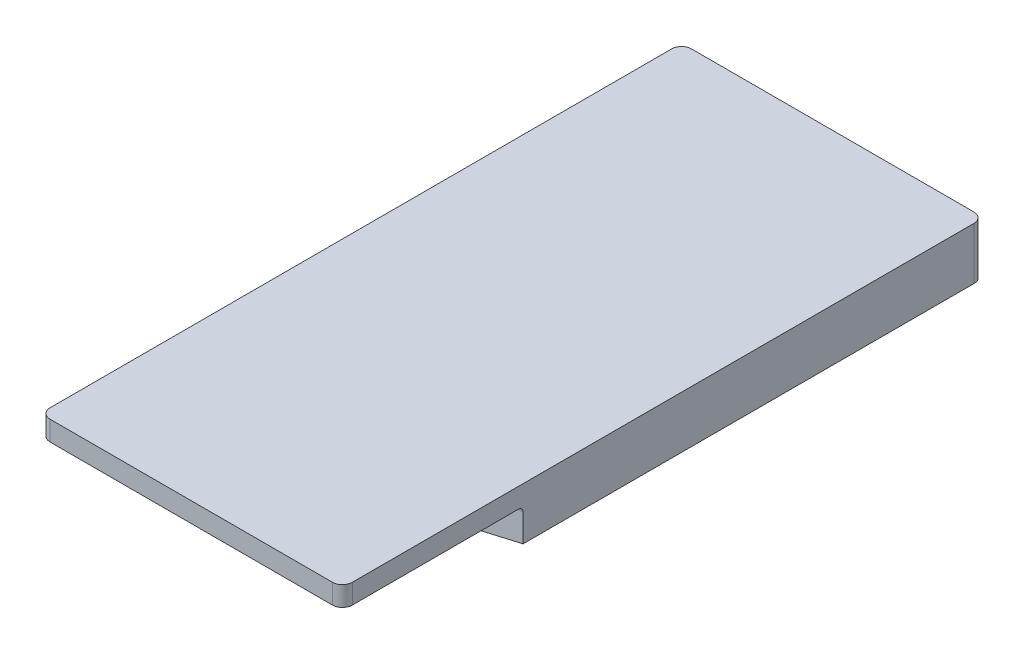
ISO-10303-21;
HEADER;
FILE_DESCRIPTION(('STEP AP214'),'2;1');
FILE_NAME('part.step','',(''),(''),'','','');
FILE_SCHEMA(('AUTOMOTIVE_DESIGN { 1 0 10303 214 1 1 1 1 }'));
ENDSEC;
DATA;
#1=APPLICATION_CONTEXT('core data for automotive mechanical design processes');
#2=APPLICATION_PROTOCOL_DEFINITION('international standard','automotive_design',2000,#1);
#3=PRODUCT_CONTEXT('',#1,'mechanical');
#4=PRODUCT('Part','Part','',(#3));
#5=PRODUCT_RELATED_PRODUCT_CATEGORY('part','',(#4));
#6=PRODUCT_DEFINITION_FORMATION('','',#4);
#7=PRODUCT_DEFINITION_CONTEXT('part definition',#1,'design');
#8=PRODUCT_DEFINITION('design','',#6,#7);
#9=PRODUCT_DEFINITION_SHAPE('','',#8);
#10=(LENGTH_UNIT() NAMED_UNIT(*) SI_UNIT(.MILLI.,.METRE.));
#11=(NAMED_UNIT(*) PLANE_ANGLE_UNIT() SI_UNIT($,.RADIAN.));
#12=(NAMED_UNIT(*) SI_UNIT($,.STERADIAN.) SOLID_ANGLE_UNIT());
#13=UNCERTAINTY_MEASURE_WITH_UNIT(LENGTH_MEASURE(1.E-05),#10,'distance_accuracy_value','');
#14=(GEOMETRIC_REPRESENTATION_CONTEXT(3) GLOBAL_UNCERTAINTY_ASSIGNED_CONTEXT((#13)) GLOBAL_UNIT_ASSIGNED_CONTEXT((#10,
#11,#12)) REPRESENTATION_CONTEXT('',''));
#15=CARTESIAN_POINT('',(0.,0.,0.));
#16=DIRECTION('',(0.,0.,1.));
#17=DIRECTION('',(1.,0.,0.));
#18=AXIS2_PLACEMENT_3D('',#15,#16,#17);
#19=CARTESIAN_POINT('',(-121.01,39.,179.75));
#20=DIRECTION('',(1.,0.,0.));
#21=DIRECTION('',(0.,0.,-1.));
#22=AXIS2_PLACEMENT_3D('',#19,#20,#21);
#23=PLANE('',#22);
#24=DIRECTION('',(0.,-1.,0.));
#25=VECTOR('',#24,1.);
#26=CARTESIAN_POINT('',(-121.01,39.,-411.75));
#27=LINE('',#26,#25);
#28=CARTESIAN_POINT('',(-121.01,39.,-411.75));
#29=VERTEX_POINT('',#28);
#30=CARTESIAN_POINT('',(-121.01,20.009665474438,-411.75));
#31=VERTEX_POINT('',#30);
#32=EDGE_CURVE('E462',#29,#31,#27,.T.);
#33=ORIENTED_EDGE('',*,*,#32,.F.);
#34=DIRECTION('',(0.,0.,-1.));
#35=VECTOR('',#34,1.);
#36=CARTESIAN_POINT('',(-121.01,39.,179.75));
#37=LINE('',#36,#35);
#38=CARTESIAN_POINT('',(-121.01,39.,179.75));
#39=VERTEX_POINT('',#38);
#40=EDGE_CURVE('E238',#39,#29,#37,.T.);
#41=ORIENTED_EDGE('',*,*,#40,.F.);
#42=DIRECTION('',(0.,-1.,0.));
#43=VECTOR('',#42,1.);
#44=CARTESIAN_POINT('',(-121.01,39.,179.75));
#45=LINE('',#44,#43);
#46=CARTESIAN_POINT('',(-121.01,20.009665474438,179.75));
#47=VERTEX_POINT('',#46);
#48=EDGE_CURVE('E233',#39,#47,#45,.T.);
#49=ORIENTED_EDGE('',*,*,#48,.T.);
#50=DIRECTION('',(0.,0.,-1.));
#51=VECTOR('',#50,1.);
#52=CARTESIAN_POINT('',(-121.01,20.009665474438,179.75));
#53=LINE('',#52,#51);
#54=EDGE_CURVE('E215',#47,#31,#53,.T.);
#55=ORIENTED_EDGE('',*,*,#54,.T.);
#56=EDGE_LOOP('',(#33,#41,#49,#55));
#57=FACE_BOUND('',#56,.T.);
#58=ADVANCED_FACE('F45',(#57),#23,.T.);
#59=CARTESIAN_POINT('',(-88.51,39.,179.75));
#60=DIRECTION('',(0.,0.,-1.));
#61=DIRECTION('',(-1.,0.,0.));
#62=AXIS2_PLACEMENT_3D('',#59,#60,#61);
#63=CYLINDRICAL_SURFACE('',#62,32.5);
#64=CARTESIAN_POINT('',(-88.51,39.,-411.75));
#65=DIRECTION('',(0.,0.,1.));
#66=DIRECTION('',(1.,0.,0.));
#67=AXIS2_PLACEMENT_3D('',#64,#65,#66);
#68=CIRCLE('',#67,32.5);
#69=CARTESIAN_POINT('',(-56.01,39.,-411.75));
#70=VERTEX_POINT('',#69);
#71=EDGE_CURVE('E240',#70,#29,#68,.T.);
#72=ORIENTED_EDGE('',*,*,#71,.F.);
#73=DIRECTION('',(0.,0.,-1.));
#74=VECTOR('',#73,1.);
#75=CARTESIAN_POINT('',(-56.01,39.,179.75));
#76=LINE('',#75,#74);
#77=CARTESIAN_POINT('',(-56.01,39.,179.75));
#78=VERTEX_POINT('',#77);
#79=EDGE_CURVE('E466',#78,#70,#76,.T.);
#80=ORIENTED_EDGE('',*,*,#79,.F.);
#81=CARTESIAN_POINT('',(-88.51,39.,179.75));
#82=DIRECTION('',(0.,0.,1.));
#83=DIRECTION('',(1.,0.,0.));
#84=AXIS2_PLACEMENT_3D('',#81,#82,#83);
#85=CIRCLE('',#84,32.5);
#86=EDGE_CURVE('E228',#78,#39,#85,.T.);
#87=ORIENTED_EDGE('',*,*,#86,.T.);
#88=ORIENTED_EDGE('',*,*,#40,.T.);
#89=EDGE_LOOP('',(#72,#80,#87,#88));
#90=FACE_BOUND('',#89,.T.);
#91=ADVANCED_FACE('F564',(#90),#63,.F.);
#92=CARTESIAN_POINT('',(-56.01,5.20647328174899,179.75));
#93=DIRECTION('',(-1.,0.,0.));
#94=DIRECTION('',(0.,-1.,0.));
#95=AXIS2_PLACEMENT_3D('',#92,#93,#94);
#96=PLANE('',#95);
#97=DIRECTION('',(0.,1.,0.));
#98=VECTOR('',#97,1.);
#99=CARTESIAN_POINT('',(-56.01,5.20647328174899,-411.75));
#100=LINE('',#99,#98);
#101=CARTESIAN_POINT('',(-56.0099999999999,5.20647328174895,-411.75));
#102=VERTEX_POINT('',#101);
#103=EDGE_CURVE('E245',#102,#70,#100,.T.);
#104=ORIENTED_EDGE('',*,*,#103,.F.);
#105=DIRECTION('',(0.,0.,-1.));
#106=VECTOR('',#105,1.);
#107=CARTESIAN_POINT('',(-56.0099999999999,5.20647328174895,179.75));
#108=LINE('',#107,#106);
#109=CARTESIAN_POINT('',(-56.0099999999999,5.20647328174895,179.75));
#110=VERTEX_POINT('',#109);
#111=EDGE_CURVE('E436',#110,#102,#108,.T.);
#112=ORIENTED_EDGE('',*,*,#111,.F.);
#113=DIRECTION('',(0.,1.,0.));
#114=VECTOR('',#113,1.);
#115=CARTESIAN_POINT('',(-56.01,5.20647328174899,179.75));
#116=LINE('',#115,#114);
#117=EDGE_CURVE('E452',#110,#78,#116,.T.);
#118=ORIENTED_EDGE('',*,*,#117,.T.);
#119=ORIENTED_EDGE('',*,*,#79,.T.);
#120=EDGE_LOOP('',(#104,#112,#118,#119));
#121=FACE_BOUND('',#120,.T.);
#122=ADVANCED_FACE('F569',(#121),#96,.T.);
#123=CARTESIAN_POINT('',(0.,303.874359168,179.75));
#124=DIRECTION('',(0.,0.,-1.));
#125=DIRECTION('',(-1.,0.,0.));
#126=AXIS2_PLACEMENT_3D('',#123,#124,#125);
#127=CYLINDRICAL_SURFACE('',#126,303.874359168);
#128=CARTESIAN_POINT('',(0.,303.874359168,-411.75));
#129=DIRECTION('',(0.,0.,-1.));
#130=DIRECTION('',(-1.,0.,0.));
#131=AXIS2_PLACEMENT_3D('',#128,#129,#130);
#132=CIRCLE('',#131,303.874359168);
#133=CARTESIAN_POINT('',(56.01,5.20647328174897,-411.75));
#134=VERTEX_POINT('',#133);
#135=EDGE_CURVE('E474',#134,#102,#132,.T.);
#136=ORIENTED_EDGE('',*,*,#135,.F.);
#137=DIRECTION('',(0.,0.,-1.));
#138=VECTOR('',#137,1.);
#139=CARTESIAN_POINT('',(56.01,5.20647328174897,179.75));
#140=LINE('',#139,#138);
#141=CARTESIAN_POINT('',(56.01,5.20647328174897,179.75));
#142=VERTEX_POINT('',#141);
#143=EDGE_CURVE('E432',#142,#134,#140,.T.);
#144=ORIENTED_EDGE('',*,*,#143,.F.);
#145=CARTESIAN_POINT('',(0.,303.874359168,179.75));
#146=DIRECTION('',(0.,0.,-1.));
#147=DIRECTION('',(-1.,0.,0.));
#148=AXIS2_PLACEMENT_3D('',#145,#146,#147);
#149=CIRCLE('',#148,303.874359168);
#150=EDGE_CURVE('E446',#142,#110,#149,.T.);
#151=ORIENTED_EDGE('',*,*,#150,.T.);
#152=ORIENTED_EDGE('',*,*,#111,.T.);
#153=EDGE_LOOP('',(#136,#144,#151,#152));
#154=FACE_BOUND('',#153,.T.);
#155=ADVANCED_FACE('F516',(#154),#127,.T.);
#156=CARTESIAN_POINT('',(56.01,39.,179.75));
#157=DIRECTION('',(1.,0.,0.));
#158=DIRECTION('',(0.,0.,-1.));
#159=AXIS2_PLACEMENT_3D('',#156,#157,#158);
#160=PLANE('',#159);
#161=DIRECTION('',(0.,-1.,0.));
#162=VECTOR('',#161,1.);
#163=CARTESIAN_POINT('',(56.01,39.,-411.75));
#164=LINE('',#163,#162);
#165=CARTESIAN_POINT('',(56.01,39.,-411.75));
#166=VERTEX_POINT('',#165);
#167=EDGE_CURVE('E479',#166,#134,#164,.T.);
#168=ORIENTED_EDGE('',*,*,#167,.F.);
#169=DIRECTION('',(0.,0.,-1.));
#170=VECTOR('',#169,1.);
#171=CARTESIAN_POINT('',(56.01,39.,179.75));
#172=LINE('',#171,#170);
#173=CARTESIAN_POINT('',(56.01,39.,179.75));
#174=VERTEX_POINT('',#173);
#175=EDGE_CURVE('E428',#174,#166,#172,.T.);
#176=ORIENTED_EDGE('',*,*,#175,.F.);
#177=DIRECTION('',(0.,-1.,0.));
#178=VECTOR('',#177,1.);
#179=CARTESIAN_POINT('',(56.01,39.,179.75));
#180=LINE('',#179,#178);
#181=EDGE_CURVE('E453',#174,#142,#180,.T.);
#182=ORIENTED_EDGE('',*,*,#181,.T.);
#183=ORIENTED_EDGE('',*,*,#143,.T.);
#184=EDGE_LOOP('',(#168,#176,#182,#183));
#185=FACE_BOUND('',#184,.T.);
#186=ADVANCED_FACE('F510',(#185),#160,.T.);
#187=CARTESIAN_POINT('',(88.51,39.,179.75));
#188=DIRECTION('',(0.,0.,-1.));
#189=DIRECTION('',(-1.,0.,0.));
#190=AXIS2_PLACEMENT_3D('',#187,#188,#189);
#191=CYLINDRICAL_SURFACE('',#190,32.5);
#192=CARTESIAN_POINT('',(88.51,39.,-411.75));
#193=DIRECTION('',(0.,0.,1.));
#194=DIRECTION('',(1.,0.,0.));
#195=AXIS2_PLACEMENT_3D('',#192,#193,#194);
#196=CIRCLE('',#195,32.5);
#197=CARTESIAN_POINT('',(121.01,39.,-411.75));
#198=VERTEX_POINT('',#197);
#199=EDGE_CURVE('E483',#198,#166,#196,.T.);
#200=ORIENTED_EDGE('',*,*,#199,.F.);
#201=DIRECTION('',(0.,0.,-1.));
#202=VECTOR('',#201,1.);
#203=CARTESIAN_POINT('',(121.01,39.,179.75));
#204=LINE('',#203,#202);
#205=CARTESIAN_POINT('',(121.01,39.,179.75));
#206=VERTEX_POINT('',#205);
#207=EDGE_CURVE('E425',#206,#198,#204,.T.);
#208=ORIENTED_EDGE('',*,*,#207,.F.);
#209=CARTESIAN_POINT('',(88.51,39.,179.75));
#210=DIRECTION('',(0.,0.,1.));
#211=DIRECTION('',(1.,0.,0.));
#212=AXIS2_PLACEMENT_3D('',#209,#210,#211);
#213=CIRCLE('',#212,32.5);
#214=EDGE_CURVE('E499',#206,#174,#213,.T.);
#215=ORIENTED_EDGE('',*,*,#214,.T.);
#216=ORIENTED_EDGE('',*,*,#175,.T.);
#217=EDGE_LOOP('',(#200,#208,#215,#216));
#218=FACE_BOUND('',#217,.T.);
#219=ADVANCED_FACE('F635',(#218),#191,.F.);
#220=CARTESIAN_POINT('',(121.01,20.009665474438,179.75));
#221=DIRECTION('',(-1.,0.,0.));
#222=DIRECTION('',(0.,0.,1.));
#223=AXIS2_PLACEMENT_3D('',#220,#221,#222);
#224=PLANE('',#223);
#225=DIRECTION('',(0.,1.,0.));
#226=VECTOR('',#225,1.);
#227=CARTESIAN_POINT('',(121.01,20.009665474438,-411.75));
#228=LINE('',#227,#226);
#229=CARTESIAN_POINT('',(121.01,20.009665474438,-411.75));
#230=VERTEX_POINT('',#229);
#231=EDGE_CURVE('E402',#230,#198,#228,.T.);
#232=ORIENTED_EDGE('',*,*,#231,.F.);
#233=DIRECTION('',(0.,0.,-1.));
#234=VECTOR('',#233,1.);
#235=CARTESIAN_POINT('',(121.01,20.009665474438,179.75));
#236=LINE('',#235,#234);
#237=CARTESIAN_POINT('',(121.01,20.009665474438,179.75));
#238=VERTEX_POINT('',#237);
#239=EDGE_CURVE('E373',#238,#230,#236,.T.);
#240=ORIENTED_EDGE('',*,*,#239,.F.);
#241=DIRECTION('',(0.,1.,0.));
#242=VECTOR('',#241,1.);
#243=CARTESIAN_POINT('',(121.01,20.009665474438,179.75));
#244=LINE('',#243,#242);
#245=EDGE_CURVE('E495',#238,#206,#244,.T.);
#246=ORIENTED_EDGE('',*,*,#245,.T.);
#247=ORIENTED_EDGE('',*,*,#207,.T.);
#248=EDGE_LOOP('',(#232,#240,#246,#247));
#249=FACE_BOUND('',#248,.T.);
#250=ADVANCED_FACE('F639',(#249),#224,.T.);
#251=CARTESIAN_POINT('',(194.010451035,36.9541925117447,179.75));
#252=DIRECTION('',(0.226104305200991,-0.974103096786771,0.));
#253=DIRECTION('',(0.974103096786771,0.226104305200991,0.));
#254=AXIS2_PLACEMENT_3D('',#251,#252,#253);
#255=PLANE('',#254);
#256=DIRECTION('',(-0.974103096786771,-0.226104305200991,0.));
#257=VECTOR('',#256,1.);
#258=CARTESIAN_POINT('',(194.010451035,36.9541925117447,-411.75));
#259=LINE('',#258,#257);
#260=CARTESIAN_POINT('',(181.310451035,34.006327254438,-411.75));
#261=VERTEX_POINT('',#260);
#262=EDGE_CURVE('E366',#261,#230,#259,.T.);
#263=ORIENTED_EDGE('',*,*,#262,.F.);
#264=CARTESIAN_POINT('',(181.310451035,34.006327254438,-399.05));
#265=DIRECTION('',(0.226104305200991,-0.974103096786771,0.));
#266=DIRECTION('',(0.974103096786771,0.226104305200991,0.));
#267=AXIS2_PLACEMENT_3D('',#264,#265,#266);
#268=ELLIPSE('',#267,13.0376343550214,12.7);
#269=CARTESIAN_POINT('',(194.010451035,36.9541925117447,-399.05));
#270=VERTEX_POINT('',#269);
#271=EDGE_CURVE('E290',#261,#270,#268,.T.);
#272=ORIENTED_EDGE('',*,*,#271,.T.);
#273=DIRECTION('',(0.,0.,-1.));
#274=VECTOR('',#273,1.);
#275=CARTESIAN_POINT('',(194.010451035,36.9541925117447,179.75));
#276=LINE('',#275,#274);
#277=CARTESIAN_POINT('',(194.010451035,36.9541925117447,179.75));
#278=VERTEX_POINT('',#277);
#279=EDGE_CURVE('E363',#278,#270,#276,.T.);
#280=ORIENTED_EDGE('',*,*,#279,.F.);
#281=DIRECTION('',(-0.974103096786771,-0.226104305200991,0.));
#282=VECTOR('',#281,1.);
#283=CARTESIAN_POINT('',(194.010451035,36.9541925117447,179.75));
#284=LINE('',#283,#282);
#285=EDGE_CURVE('E492',#278,#238,#284,.T.);
#286=ORIENTED_EDGE('',*,*,#285,.T.);
#287=ORIENTED_EDGE('',*,*,#239,.T.);
#288=EDGE_LOOP('',(#263,#272,#280,#286,#287));
#289=FACE_BOUND('',#288,.T.);
#290=ADVANCED_FACE('F361',(#289),#255,.T.);
#291=CARTESIAN_POINT('',(194.010451035,103.904192512,179.75));
#292=DIRECTION('',(1.,0.,0.));
#293=DIRECTION('',(0.,1.,0.));
#294=AXIS2_PLACEMENT_3D('',#291,#292,#293);
#295=PLANE('',#294);
#296=DIRECTION('',(0.,0.,-1.));
#297=VECTOR('',#296,1.);
#298=CARTESIAN_POINT('',(194.010451035,103.904192512,179.75));
#299=LINE('',#298,#297);
#300=CARTESIAN_POINT('',(194.010451035,103.904192512,399.05));
#301=VERTEX_POINT('',#300);
#302=CARTESIAN_POINT('',(194.010451035,103.904192512,-399.05));
#303=VERTEX_POINT('',#302);
#304=EDGE_CURVE('E374',#301,#303,#299,.T.);
#305=ORIENTED_EDGE('',*,*,#304,.F.);
#306=DIRECTION('',(0.,1.,0.));
#307=VECTOR('',#306,1.);
#308=CARTESIAN_POINT('',(194.010451035,78.5,399.05));
#309=LINE('',#308,#307);
#310=CARTESIAN_POINT('',(194.010451035,78.5,399.05));
#311=VERTEX_POINT('',#310);
#312=EDGE_CURVE('E339',#301,#311,#309,.F.);
#313=ORIENTED_EDGE('',*,*,#312,.T.);
#314=DIRECTION('',(0.,0.,-1.));
#315=VECTOR('',#314,1.);
#316=CARTESIAN_POINT('',(194.010451035,78.5,411.75));
#317=LINE('',#316,#315);
#318=CARTESIAN_POINT('',(194.010451035,78.5,186.1));
#319=VERTEX_POINT('',#318);
#320=EDGE_CURVE('E304',#311,#319,#317,.T.);
#321=ORIENTED_EDGE('',*,*,#320,.T.);
#322=CARTESIAN_POINT('',(194.010451035,72.15,186.1));
#323=DIRECTION('',(1.,0.,0.));
#324=DIRECTION('',(0.,1.,0.));
#325=AXIS2_PLACEMENT_3D('',#322,#323,#324);
#326=CIRCLE('',#325,6.34999999999999);
#327=CARTESIAN_POINT('',(194.010451035,72.15,179.75));
#328=VERTEX_POINT('',#327);
#329=EDGE_CURVE('E55',#319,#328,#326,.F.);
#330=ORIENTED_EDGE('',*,*,#329,.T.);
#331=DIRECTION('',(0.,-1.,0.));
#332=VECTOR('',#331,1.);
#333=CARTESIAN_POINT('',(194.010451035,103.904192512,179.75));
#334=LINE('',#333,#332);
#335=EDGE_CURVE('E372',#328,#278,#334,.T.);
#336=ORIENTED_EDGE('',*,*,#335,.T.);
#337=ORIENTED_EDGE('',*,*,#279,.T.);
#338=DIRECTION('',(0.,-1.,0.));
#339=VECTOR('',#338,1.);
#340=CARTESIAN_POINT('',(194.010451035,103.904192512,-399.05));
#341=LINE('',#340,#339);
#342=EDGE_CURVE('E336',#270,#303,#341,.F.);
#343=ORIENTED_EDGE('',*,*,#342,.T.);
#344=EDGE_LOOP('',(#305,#313,#321,#330,#336,#337,#343));
#345=FACE_BOUND('',#344,.T.);
#346=ADVANCED_FACE('F370',(#345),#295,.T.);
#347=CARTESIAN_POINT('',(-194.010451035,103.904192512,179.75));
#348=DIRECTION('',(0.,1.,0.));
#349=DIRECTION('',(0.,0.,1.));
#350=AXIS2_PLACEMENT_3D('',#347,#348,#349);
#351=PLANE('',#350);
#352=DIRECTION('',(0.,0.,-1.));
#353=VECTOR('',#352,1.);
#354=CARTESIAN_POINT('',(-194.010451035,103.904192512,179.75));
#355=LINE('',#354,#353);
#356=CARTESIAN_POINT('',(-194.010451035,103.904192512,399.05));
#357=VERTEX_POINT('',#356);
#358=CARTESIAN_POINT('',(-194.010451035,103.904192512,-399.05));
#359=VERTEX_POINT('',#358);
#360=EDGE_CURVE('E418',#357,#359,#355,.T.);
#361=ORIENTED_EDGE('',*,*,#360,.F.);
#362=CARTESIAN_POINT('',(-181.310451035,103.904192512,399.05));
#363=DIRECTION('',(0.,1.,0.));
#364=DIRECTION('',(0.,0.,1.));
#365=AXIS2_PLACEMENT_3D('',#362,#363,#364);
#366=CIRCLE('',#365,12.7);
#367=CARTESIAN_POINT('',(-181.310451035,103.904192512,411.75));
#368=VERTEX_POINT('',#367);
#369=EDGE_CURVE('E329',#357,#368,#366,.T.);
#370=ORIENTED_EDGE('',*,*,#369,.T.);
#371=DIRECTION('',(-1.,0.,0.));
#372=VECTOR('',#371,1.);
#373=CARTESIAN_POINT('',(-194.010451035,103.904192512,411.75));
#374=LINE('',#373,#372);
#375=CARTESIAN_POINT('',(181.310451035,103.904192512,411.75));
#376=VERTEX_POINT('',#375);
#377=EDGE_CURVE('E312',#376,#368,#374,.T.);
#378=ORIENTED_EDGE('',*,*,#377,.F.);
#379=CARTESIAN_POINT('',(181.310451035,103.904192512,399.05));
#380=DIRECTION('',(0.,1.,0.));
#381=DIRECTION('',(0.,0.,1.));
#382=AXIS2_PLACEMENT_3D('',#379,#380,#381);
#383=CIRCLE('',#382,12.7);
#384=EDGE_CURVE('E325',#376,#301,#383,.T.);
#385=ORIENTED_EDGE('',*,*,#384,.T.);
#386=ORIENTED_EDGE('',*,*,#304,.T.);
#387=CARTESIAN_POINT('',(181.310451035,103.904192512,-399.05));
#388=DIRECTION('',(0.,1.,0.));
#389=DIRECTION('',(0.,0.,1.));
#390=AXIS2_PLACEMENT_3D('',#387,#388,#389);
#391=CIRCLE('',#390,12.7);
#392=CARTESIAN_POINT('',(181.310451035,103.904192512,-411.75));
#393=VERTEX_POINT('',#392);
#394=EDGE_CURVE('E330',#303,#393,#391,.T.);
#395=ORIENTED_EDGE('',*,*,#394,.T.);
#396=DIRECTION('',(1.,0.,0.));
#397=VECTOR('',#396,1.);
#398=CARTESIAN_POINT('',(-194.010451035,103.904192512,-411.75));
#399=LINE('',#398,#397);
#400=CARTESIAN_POINT('',(-181.310451035,103.904192512,-411.75));
#401=VERTEX_POINT('',#400);
#402=EDGE_CURVE('E395',#401,#393,#399,.T.);
#403=ORIENTED_EDGE('',*,*,#402,.F.);
#404=CARTESIAN_POINT('',(-181.310451035,103.904192512,-399.05));
#405=DIRECTION('',(0.,1.,0.));
#406=DIRECTION('',(0.,0.,1.));
#407=AXIS2_PLACEMENT_3D('',#404,#405,#406);
#408=CIRCLE('',#407,12.7);
#409=EDGE_CURVE('E381',#401,#359,#408,.T.);
#410=ORIENTED_EDGE('',*,*,#409,.T.);
#411=EDGE_LOOP('',(#361,#370,#378,#385,#386,#395,#403,#410));
#412=FACE_BOUND('',#411,.T.);
#413=ADVANCED_FACE('F552',(#412),#351,.T.);
#414=CARTESIAN_POINT('',(-194.010451035,36.9541925117447,179.75));
#415=DIRECTION('',(-1.,0.,0.));
#416=DIRECTION('',(0.,-1.,0.));
#417=AXIS2_PLACEMENT_3D('',#414,#415,#416);
#418=PLANE('',#417);
#419=DIRECTION('',(0.,0.,-1.));
#420=VECTOR('',#419,1.);
#421=CARTESIAN_POINT('',(-194.010451035,78.5,411.75));
#422=LINE('',#421,#420);
#423=CARTESIAN_POINT('',(-194.010451035,78.5,399.05));
#424=VERTEX_POINT('',#423);
#425=CARTESIAN_POINT('',(-194.010451035,78.5,186.1));
#426=VERTEX_POINT('',#425);
#427=EDGE_CURVE('E249',#424,#426,#422,.T.);
#428=ORIENTED_EDGE('',*,*,#427,.F.);
#429=DIRECTION('',(0.,-1.,0.));
#430=VECTOR('',#429,1.);
#431=CARTESIAN_POINT('',(-194.010451035,103.904192512,399.05));
#432=LINE('',#431,#430);
#433=EDGE_CURVE('E384',#424,#357,#432,.F.);
#434=ORIENTED_EDGE('',*,*,#433,.T.);
#435=ORIENTED_EDGE('',*,*,#360,.T.);
#436=DIRECTION('',(0.,1.,0.));
#437=VECTOR('',#436,1.);
#438=CARTESIAN_POINT('',(-194.010451035,36.9541925117447,-399.05));
#439=LINE('',#438,#437);
#440=CARTESIAN_POINT('',(-194.010451035,36.9541925117447,-399.05));
#441=VERTEX_POINT('',#440);
#442=EDGE_CURVE('E388',#359,#441,#439,.F.);
#443=ORIENTED_EDGE('',*,*,#442,.T.);
#444=DIRECTION('',(0.,0.,-1.));
#445=VECTOR('',#444,1.);
#446=CARTESIAN_POINT('',(-194.010451035,36.9541925117447,179.75));
#447=LINE('',#446,#445);
#448=CARTESIAN_POINT('',(-194.010451035,36.9541925117447,179.75));
#449=VERTEX_POINT('',#448);
#450=EDGE_CURVE('E227',#449,#441,#447,.T.);
#451=ORIENTED_EDGE('',*,*,#450,.F.);
#452=DIRECTION('',(0.,1.,0.));
#453=VECTOR('',#452,1.);
#454=CARTESIAN_POINT('',(-194.010451035,36.9541925117447,179.75));
#455=LINE('',#454,#453);
#456=CARTESIAN_POINT('',(-194.010451035,72.15,179.75));
#457=VERTEX_POINT('',#456);
#458=EDGE_CURVE('E235',#449,#457,#455,.T.);
#459=ORIENTED_EDGE('',*,*,#458,.T.);
#460=CARTESIAN_POINT('',(-194.010451035,72.15,186.1));
#461=DIRECTION('',(-1.,0.,0.));
#462=DIRECTION('',(0.,-1.,0.));
#463=AXIS2_PLACEMENT_3D('',#460,#461,#462);
#464=CIRCLE('',#463,6.34999999999999);
#465=EDGE_CURVE('E12',#457,#426,#464,.F.);
#466=ORIENTED_EDGE('',*,*,#465,.T.);
#467=EDGE_LOOP('',(#428,#434,#435,#443,#451,#459,#466));
#468=FACE_BOUND('',#467,.T.);
#469=ADVANCED_FACE('F546',(#468),#418,.T.);
#470=CARTESIAN_POINT('',(-121.01,20.009665474438,179.75));
#471=DIRECTION('',(-0.22610430520099,-0.974103096786771,0.));
#472=DIRECTION('',(0.974103096786771,-0.22610430520099,0.));
#473=AXIS2_PLACEMENT_3D('',#470,#471,#472);
#474=PLANE('',#473);
#475=ORIENTED_EDGE('',*,*,#450,.T.);
#476=CARTESIAN_POINT('',(-181.310451035,34.006327254438,-399.05));
#477=DIRECTION('',(-0.22610430520099,-0.974103096786771,0.));
#478=DIRECTION('',(0.974103096786771,-0.22610430520099,0.));
#479=AXIS2_PLACEMENT_3D('',#476,#477,#478);
#480=ELLIPSE('',#479,13.0376343550214,12.7);
#481=CARTESIAN_POINT('',(-181.310451035,34.006327254438,-411.75));
#482=VERTEX_POINT('',#481);
#483=EDGE_CURVE('E284',#441,#482,#480,.T.);
#484=ORIENTED_EDGE('',*,*,#483,.T.);
#485=DIRECTION('',(-0.974103096786771,0.22610430520099,0.));
#486=VECTOR('',#485,1.);
#487=CARTESIAN_POINT('',(-121.01,20.009665474438,-411.75));
#488=LINE('',#487,#486);
#489=EDGE_CURVE('E221',#31,#482,#488,.T.);
#490=ORIENTED_EDGE('',*,*,#489,.F.);
#491=ORIENTED_EDGE('',*,*,#54,.F.);
#492=DIRECTION('',(-0.974103096786771,0.22610430520099,0.));
#493=VECTOR('',#492,1.);
#494=CARTESIAN_POINT('',(-121.01,20.009665474438,179.75));
#495=LINE('',#494,#493);
#496=EDGE_CURVE('E219',#47,#449,#495,.T.);
#497=ORIENTED_EDGE('',*,*,#496,.T.);
#498=EDGE_LOOP('',(#475,#484,#490,#491,#497));
#499=FACE_BOUND('',#498,.T.);
#500=ADVANCED_FACE('F218',(#499),#474,.T.);
#501=CARTESIAN_POINT('',(88.51,39.,179.75));
#502=DIRECTION('',(0.,0.,1.));
#503=DIRECTION('',(1.,0.,0.));
#504=AXIS2_PLACEMENT_3D('',#501,#502,#503);
#505=PLANE('',#504);
#506=ORIENTED_EDGE('',*,*,#335,.F.);
#507=DIRECTION('',(1.,0.,0.));
#508=VECTOR('',#507,1.);
#509=CARTESIAN_POINT('',(88.51,72.15,179.75));
#510=LINE('',#509,#508);
#511=EDGE_CURVE('E71',#328,#457,#510,.F.);
#512=ORIENTED_EDGE('',*,*,#511,.T.);
#513=ORIENTED_EDGE('',*,*,#458,.F.);
#514=ORIENTED_EDGE('',*,*,#496,.F.);
#515=ORIENTED_EDGE('',*,*,#48,.F.);
#516=ORIENTED_EDGE('',*,*,#86,.F.);
#517=ORIENTED_EDGE('',*,*,#117,.F.);
#518=ORIENTED_EDGE('',*,*,#150,.F.);
#519=ORIENTED_EDGE('',*,*,#181,.F.);
#520=ORIENTED_EDGE('',*,*,#214,.F.);
#521=ORIENTED_EDGE('',*,*,#245,.F.);
#522=ORIENTED_EDGE('',*,*,#285,.F.);
#523=EDGE_LOOP('',(#506,#512,#513,#514,#515,#516,#517,#518,#519,#520,#521,#522));
#524=FACE_BOUND('',#523,.T.);
#525=ADVANCED_FACE('F231',(#524),#505,.T.);
#526=CARTESIAN_POINT('',(88.51,39.,-411.75));
#527=DIRECTION('',(0.,0.,1.));
#528=DIRECTION('',(1.,0.,0.));
#529=AXIS2_PLACEMENT_3D('',#526,#527,#528);
#530=PLANE('',#529);
#531=ORIENTED_EDGE('',*,*,#402,.T.);
#532=DIRECTION('',(0.,-1.,0.));
#533=VECTOR('',#532,1.);
#534=CARTESIAN_POINT('',(181.310451035,36.9541925117447,-411.75));
#535=LINE('',#534,#533);
#536=EDGE_CURVE('E345',#393,#261,#535,.T.);
#537=ORIENTED_EDGE('',*,*,#536,.T.);
#538=ORIENTED_EDGE('',*,*,#262,.T.);
#539=ORIENTED_EDGE('',*,*,#231,.T.);
#540=ORIENTED_EDGE('',*,*,#199,.T.);
#541=ORIENTED_EDGE('',*,*,#167,.T.);
#542=ORIENTED_EDGE('',*,*,#135,.T.);
#543=ORIENTED_EDGE('',*,*,#103,.T.);
#544=ORIENTED_EDGE('',*,*,#71,.T.);
#545=ORIENTED_EDGE('',*,*,#32,.T.);
#546=ORIENTED_EDGE('',*,*,#489,.T.);
#547=DIRECTION('',(0.,1.,0.));
#548=VECTOR('',#547,1.);
#549=CARTESIAN_POINT('',(-181.310451035,103.904192512,-411.75));
#550=LINE('',#549,#548);
#551=EDGE_CURVE('E341',#482,#401,#550,.T.);
#552=ORIENTED_EDGE('',*,*,#551,.T.);
#553=EDGE_LOOP('',(#531,#537,#538,#539,#540,#541,#542,#543,#544,#545,#546,#552));
#554=FACE_BOUND('',#553,.T.);
#555=ADVANCED_FACE('F519',(#554),#530,.F.);
#556=CARTESIAN_POINT('',(194.010451035,78.5,411.75));
#557=DIRECTION('',(0.,1.,0.));
#558=DIRECTION('',(0.,0.,1.));
#559=AXIS2_PLACEMENT_3D('',#556,#557,#558);
#560=PLANE('',#559);
#561=ORIENTED_EDGE('',*,*,#427,.T.);
#562=DIRECTION('',(1.,0.,0.));
#563=VECTOR('',#562,1.);
#564=CARTESIAN_POINT('',(194.010451035,78.5,186.1));
#565=LINE('',#564,#563);
#566=EDGE_CURVE('E289',#426,#319,#565,.T.);
#567=ORIENTED_EDGE('',*,*,#566,.T.);
#568=ORIENTED_EDGE('',*,*,#320,.F.);
#569=CARTESIAN_POINT('',(181.310451035,78.5,399.05));
#570=DIRECTION('',(0.,1.,0.));
#571=DIRECTION('',(0.,0.,1.));
#572=AXIS2_PLACEMENT_3D('',#569,#570,#571);
#573=CIRCLE('',#572,12.7);
#574=CARTESIAN_POINT('',(181.310451035,78.5,411.75));
#575=VERTEX_POINT('',#574);
#576=EDGE_CURVE('E533',#311,#575,#573,.F.);
#577=ORIENTED_EDGE('',*,*,#576,.T.);
#578=DIRECTION('',(1.,0.,0.));
#579=VECTOR('',#578,1.);
#580=CARTESIAN_POINT('',(194.010451035,78.5,411.75));
#581=LINE('',#580,#579);
#582=CARTESIAN_POINT('',(-181.310451035,78.5,411.75));
#583=VERTEX_POINT('',#582);
#584=EDGE_CURVE('E307',#583,#575,#581,.T.);
#585=ORIENTED_EDGE('',*,*,#584,.F.);
#586=CARTESIAN_POINT('',(-181.310451035,78.5,399.05));
#587=DIRECTION('',(0.,1.,0.));
#588=DIRECTION('',(0.,0.,1.));
#589=AXIS2_PLACEMENT_3D('',#586,#587,#588);
#590=CIRCLE('',#589,12.7);
#591=EDGE_CURVE('E531',#583,#424,#590,.F.);
#592=ORIENTED_EDGE('',*,*,#591,.T.);
#593=EDGE_LOOP('',(#561,#567,#568,#577,#585,#592));
#594=FACE_BOUND('',#593,.T.);
#595=ADVANCED_FACE('F602',(#594),#560,.F.);
#596=CARTESIAN_POINT('',(0.,0.,411.75));
#597=DIRECTION('',(0.,0.,-1.));
#598=DIRECTION('',(-1.,0.,0.));
#599=AXIS2_PLACEMENT_3D('',#596,#597,#598);
#600=PLANE('',#599);
#601=ORIENTED_EDGE('',*,*,#377,.T.);
#602=DIRECTION('',(0.,-1.,0.));
#603=VECTOR('',#602,1.);
#604=CARTESIAN_POINT('',(-181.310451035,78.5,411.75));
#605=LINE('',#604,#603);
#606=EDGE_CURVE('E271',#368,#583,#605,.T.);
#607=ORIENTED_EDGE('',*,*,#606,.T.);
#608=ORIENTED_EDGE('',*,*,#584,.T.);
#609=DIRECTION('',(0.,1.,0.));
#610=VECTOR('',#609,1.);
#611=CARTESIAN_POINT('',(181.310451035,103.904192512,411.75));
#612=LINE('',#611,#610);
#613=EDGE_CURVE('E266',#575,#376,#612,.T.);
#614=ORIENTED_EDGE('',*,*,#613,.T.);
#615=EDGE_LOOP('',(#601,#607,#608,#614));
#616=FACE_BOUND('',#615,.T.);
#617=ADVANCED_FACE('F583',(#616),#600,.F.);
#618=CARTESIAN_POINT('',(-181.310451035,0.,399.05));
#619=DIRECTION('',(0.,1.,0.));
#620=DIRECTION('',(-1.,0.,0.));
#621=AXIS2_PLACEMENT_3D('',#618,#619,#620);
#622=CYLINDRICAL_SURFACE('',#621,12.7);
#623=ORIENTED_EDGE('',*,*,#369,.F.);
#624=ORIENTED_EDGE('',*,*,#433,.F.);
#625=ORIENTED_EDGE('',*,*,#591,.F.);
#626=ORIENTED_EDGE('',*,*,#606,.F.);
#627=EDGE_LOOP('',(#623,#624,#625,#626));
#628=FACE_BOUND('',#627,.T.);
#629=ADVANCED_FACE('F578',(#628),#622,.T.);
#630=CARTESIAN_POINT('',(181.310451035,0.,399.05));
#631=DIRECTION('',(0.,-1.,0.));
#632=DIRECTION('',(1.,0.,0.));
#633=AXIS2_PLACEMENT_3D('',#630,#631,#632);
#634=CYLINDRICAL_SURFACE('',#633,12.7);
#635=ORIENTED_EDGE('',*,*,#576,.F.);
#636=ORIENTED_EDGE('',*,*,#312,.F.);
#637=ORIENTED_EDGE('',*,*,#384,.F.);
#638=ORIENTED_EDGE('',*,*,#613,.F.);
#639=EDGE_LOOP('',(#635,#636,#637,#638));
#640=FACE_BOUND('',#639,.T.);
#641=ADVANCED_FACE('F582',(#640),#634,.T.);
#642=CARTESIAN_POINT('',(181.310451035,39.,-399.05));
#643=DIRECTION('',(0.,1.,0.));
#644=DIRECTION('',(-1.,0.,0.));
#645=AXIS2_PLACEMENT_3D('',#642,#643,#644);
#646=CYLINDRICAL_SURFACE('',#645,12.7);
#647=ORIENTED_EDGE('',*,*,#394,.F.);
#648=ORIENTED_EDGE('',*,*,#342,.F.);
#649=ORIENTED_EDGE('',*,*,#271,.F.);
#650=ORIENTED_EDGE('',*,*,#536,.F.);
#651=EDGE_LOOP('',(#647,#648,#649,#650));
#652=FACE_BOUND('',#651,.T.);
#653=ADVANCED_FACE('F377',(#652),#646,.T.);
#654=CARTESIAN_POINT('',(-181.310451035,39.0000000000001,-399.05));
#655=DIRECTION('',(0.,-1.,0.));
#656=DIRECTION('',(1.,0.,0.));
#657=AXIS2_PLACEMENT_3D('',#654,#655,#656);
#658=CYLINDRICAL_SURFACE('',#657,12.7);
#659=ORIENTED_EDGE('',*,*,#483,.F.);
#660=ORIENTED_EDGE('',*,*,#442,.F.);
#661=ORIENTED_EDGE('',*,*,#409,.F.);
#662=ORIENTED_EDGE('',*,*,#551,.F.);
#663=EDGE_LOOP('',(#659,#660,#661,#662));
#664=FACE_BOUND('',#663,.T.);
#665=ADVANCED_FACE('F551',(#664),#658,.T.);
#666=CARTESIAN_POINT('',(194.010451035,72.15,186.1));
#667=DIRECTION('',(1.,0.,0.));
#668=DIRECTION('',(0.,0.,-1.));
#669=AXIS2_PLACEMENT_3D('',#666,#667,#668);
#670=CYLINDRICAL_SURFACE('',#669,6.34999999999999);
#671=ORIENTED_EDGE('',*,*,#465,.F.);
#672=ORIENTED_EDGE('',*,*,#511,.F.);
#673=ORIENTED_EDGE('',*,*,#329,.F.);
#674=ORIENTED_EDGE('',*,*,#566,.F.);
#675=EDGE_LOOP('',(#671,#672,#673,#674));
#676=FACE_BOUND('',#675,.T.);
#677=ADVANCED_FACE('F48',(#676),#670,.F.);
#678=CLOSED_SHELL('',(#58,#91,#122,#155,#186,#219,#250,#290,#346,#413,#469,#500,#525,#555,#595,
#617,#629,#641,#653,#665,#677));
#679=MANIFOLD_SOLID_BREP('B2',#678);
#680=ADVANCED_BREP_SHAPE_REPRESENTATION('',(#18,#679),#14);
#681=SHAPE_DEFINITION_REPRESENTATION(#9,#680);
ENDSEC;
END-ISO-10303-21;
